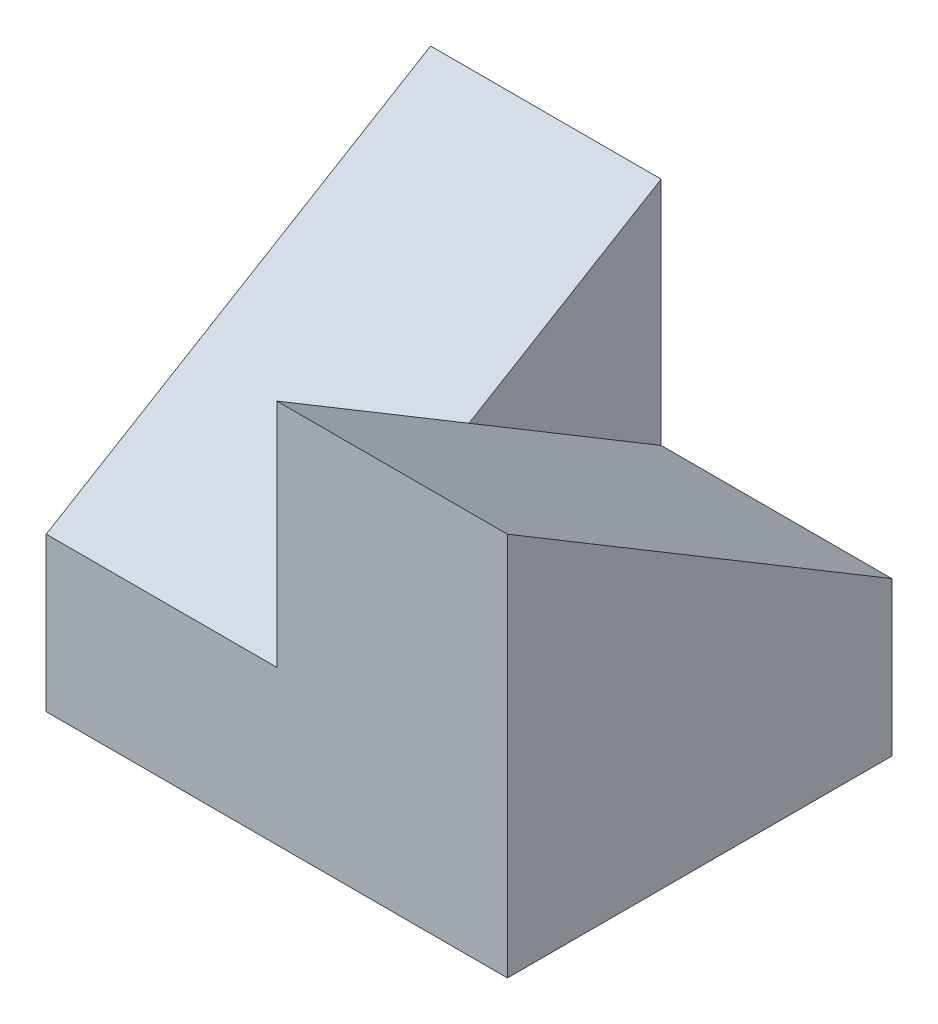
ISO-10303-21;
HEADER;
FILE_DESCRIPTION(('STEP AP214'),'2;1');
FILE_NAME('part.step','',(''),(''),'','','');
FILE_SCHEMA(('AUTOMOTIVE_DESIGN { 1 0 10303 214 1 1 1 1 }'));
ENDSEC;
DATA;
#1=APPLICATION_CONTEXT('core data for automotive mechanical design processes');
#2=APPLICATION_PROTOCOL_DEFINITION('international standard','automotive_design',2000,#1);
#3=PRODUCT_CONTEXT('',#1,'mechanical');
#4=PRODUCT('Part','Part','',(#3));
#5=PRODUCT_RELATED_PRODUCT_CATEGORY('part','',(#4));
#6=PRODUCT_DEFINITION_FORMATION('','',#4);
#7=PRODUCT_DEFINITION_CONTEXT('part definition',#1,'design');
#8=PRODUCT_DEFINITION('design','',#6,#7);
#9=PRODUCT_DEFINITION_SHAPE('','',#8);
#10=(LENGTH_UNIT() NAMED_UNIT(*) SI_UNIT(.MILLI.,.METRE.));
#11=(NAMED_UNIT(*) PLANE_ANGLE_UNIT() SI_UNIT($,.RADIAN.));
#12=(NAMED_UNIT(*) SI_UNIT($,.STERADIAN.) SOLID_ANGLE_UNIT());
#13=UNCERTAINTY_MEASURE_WITH_UNIT(LENGTH_MEASURE(1.E-05),#10,'distance_accuracy_value','');
#14=(GEOMETRIC_REPRESENTATION_CONTEXT(3) GLOBAL_UNCERTAINTY_ASSIGNED_CONTEXT((#13)) GLOBAL_UNIT_ASSIGNED_CONTEXT((#10,
#11,#12)) REPRESENTATION_CONTEXT('',''));
#15=CARTESIAN_POINT('',(0.,0.,0.));
#16=DIRECTION('',(0.,0.,1.));
#17=DIRECTION('',(1.,0.,0.));
#18=AXIS2_PLACEMENT_3D('',#15,#16,#17);
#19=CARTESIAN_POINT('',(-15.,10.,25.));
#20=DIRECTION('',(1.,0.,0.));
#21=DIRECTION('',(0.,0.,-1.));
#22=AXIS2_PLACEMENT_3D('',#19,#20,#21);
#23=PLANE('',#22);
#24=DIRECTION('',(0.,0.514495755427526,-0.857492925712544));
#25=VECTOR('',#24,1.);
#26=CARTESIAN_POINT('',(-15.,25.,0.));
#27=LINE('',#26,#25);
#28=CARTESIAN_POINT('',(-15.,10.,25.));
#29=VERTEX_POINT('',#28);
#30=CARTESIAN_POINT('',(-15.,17.5,12.5));
#31=VERTEX_POINT('',#30);
#32=EDGE_CURVE('E48',#29,#31,#27,.T.);
#33=ORIENTED_EDGE('',*,*,#32,.F.);
#34=DIRECTION('',(0.,-1.,0.));
#35=VECTOR('',#34,1.);
#36=CARTESIAN_POINT('',(-15.,10.,25.));
#37=LINE('',#36,#35);
#38=CARTESIAN_POINT('',(-15.,25.,25.));
#39=VERTEX_POINT('',#38);
#40=EDGE_CURVE('E130',#39,#29,#37,.T.);
#41=ORIENTED_EDGE('',*,*,#40,.F.);
#42=DIRECTION('',(0.,0.514495755427526,0.857492925712544));
#43=VECTOR('',#42,1.);
#44=CARTESIAN_POINT('',(-15.,10.,0.));
#45=LINE('',#44,#43);
#46=EDGE_CURVE('E111',#31,#39,#45,.T.);
#47=ORIENTED_EDGE('',*,*,#46,.F.);
#48=EDGE_LOOP('',(#33,#41,#47));
#49=FACE_BOUND('',#48,.T.);
#50=ADVANCED_FACE('F33',(#49),#23,.F.);
#51=CARTESIAN_POINT('',(-30.,0.,25.));
#52=DIRECTION('',(1.,0.,0.));
#53=DIRECTION('',(0.,0.,-1.));
#54=AXIS2_PLACEMENT_3D('',#51,#52,#53);
#55=PLANE('',#54);
#56=DIRECTION('',(0.,-1.,0.));
#57=VECTOR('',#56,1.);
#58=CARTESIAN_POINT('',(-30.,0.,0.));
#59=LINE('',#58,#57);
#60=CARTESIAN_POINT('',(-30.,25.,0.));
#61=VERTEX_POINT('',#60);
#62=CARTESIAN_POINT('',(-30.,0.,0.));
#63=VERTEX_POINT('',#62);
#64=EDGE_CURVE('E89',#61,#63,#59,.T.);
#65=ORIENTED_EDGE('',*,*,#64,.T.);
#66=DIRECTION('',(0.,0.,-1.));
#67=VECTOR('',#66,1.);
#68=CARTESIAN_POINT('',(-30.,0.,25.));
#69=LINE('',#68,#67);
#70=CARTESIAN_POINT('',(-30.,0.,25.));
#71=VERTEX_POINT('',#70);
#72=EDGE_CURVE('E41',#71,#63,#69,.T.);
#73=ORIENTED_EDGE('',*,*,#72,.F.);
#74=DIRECTION('',(0.,-1.,0.));
#75=VECTOR('',#74,1.);
#76=CARTESIAN_POINT('',(-30.,0.,25.));
#77=LINE('',#76,#75);
#78=CARTESIAN_POINT('',(-30.,10.,25.));
#79=VERTEX_POINT('',#78);
#80=EDGE_CURVE('E104',#79,#71,#77,.T.);
#81=ORIENTED_EDGE('',*,*,#80,.F.);
#82=DIRECTION('',(0.,0.514495755427526,-0.857492925712544));
#83=VECTOR('',#82,1.);
#84=CARTESIAN_POINT('',(-30.,25.,0.));
#85=LINE('',#84,#83);
#86=EDGE_CURVE('E102',#79,#61,#85,.T.);
#87=ORIENTED_EDGE('',*,*,#86,.T.);
#88=EDGE_LOOP('',(#65,#73,#81,#87));
#89=FACE_BOUND('',#88,.T.);
#90=ADVANCED_FACE('F35',(#89),#55,.F.);
#91=CARTESIAN_POINT('',(0.,0.,25.));
#92=DIRECTION('',(0.,1.,0.));
#93=DIRECTION('',(-1.,0.,0.));
#94=AXIS2_PLACEMENT_3D('',#91,#92,#93);
#95=PLANE('',#94);
#96=DIRECTION('',(1.,0.,0.));
#97=VECTOR('',#96,1.);
#98=CARTESIAN_POINT('',(0.,0.,0.));
#99=LINE('',#98,#97);
#100=CARTESIAN_POINT('',(0.,0.,0.));
#101=VERTEX_POINT('',#100);
#102=EDGE_CURVE('E96',#63,#101,#99,.T.);
#103=ORIENTED_EDGE('',*,*,#102,.T.);
#104=DIRECTION('',(0.,0.,-1.));
#105=VECTOR('',#104,1.);
#106=CARTESIAN_POINT('',(0.,0.,25.));
#107=LINE('',#106,#105);
#108=CARTESIAN_POINT('',(0.,0.,25.));
#109=VERTEX_POINT('',#108);
#110=EDGE_CURVE('E134',#109,#101,#107,.T.);
#111=ORIENTED_EDGE('',*,*,#110,.F.);
#112=DIRECTION('',(1.,0.,0.));
#113=VECTOR('',#112,1.);
#114=CARTESIAN_POINT('',(0.,0.,25.));
#115=LINE('',#114,#113);
#116=EDGE_CURVE('E121',#71,#109,#115,.T.);
#117=ORIENTED_EDGE('',*,*,#116,.F.);
#118=ORIENTED_EDGE('',*,*,#72,.T.);
#119=EDGE_LOOP('',(#103,#111,#117,#118));
#120=FACE_BOUND('',#119,.T.);
#121=ADVANCED_FACE('F141',(#120),#95,.F.);
#122=CARTESIAN_POINT('',(0.,25.,25.));
#123=DIRECTION('',(-1.,0.,0.));
#124=DIRECTION('',(0.,-1.,0.));
#125=AXIS2_PLACEMENT_3D('',#122,#123,#124);
#126=PLANE('',#125);
#127=DIRECTION('',(0.,1.,0.));
#128=VECTOR('',#127,1.);
#129=CARTESIAN_POINT('',(0.,25.,0.));
#130=LINE('',#129,#128);
#131=CARTESIAN_POINT('',(0.,10.,0.));
#132=VERTEX_POINT('',#131);
#133=EDGE_CURVE('E122',#101,#132,#130,.T.);
#134=ORIENTED_EDGE('',*,*,#133,.T.);
#135=DIRECTION('',(0.,0.514495755427526,0.857492925712544));
#136=VECTOR('',#135,1.);
#137=CARTESIAN_POINT('',(0.,25.,25.));
#138=LINE('',#137,#136);
#139=CARTESIAN_POINT('',(0.,25.,25.));
#140=VERTEX_POINT('',#139);
#141=EDGE_CURVE('E55',#132,#140,#138,.T.);
#142=ORIENTED_EDGE('',*,*,#141,.T.);
#143=DIRECTION('',(0.,1.,0.));
#144=VECTOR('',#143,1.);
#145=CARTESIAN_POINT('',(0.,25.,25.));
#146=LINE('',#145,#144);
#147=EDGE_CURVE('E124',#109,#140,#146,.T.);
#148=ORIENTED_EDGE('',*,*,#147,.F.);
#149=ORIENTED_EDGE('',*,*,#110,.T.);
#150=EDGE_LOOP('',(#134,#142,#148,#149));
#151=FACE_BOUND('',#150,.T.);
#152=ADVANCED_FACE('F168',(#151),#126,.F.);
#153=CARTESIAN_POINT('',(0.,0.,25.));
#154=DIRECTION('',(0.,0.,-1.));
#155=DIRECTION('',(-1.,0.,0.));
#156=AXIS2_PLACEMENT_3D('',#153,#154,#155);
#157=PLANE('',#156);
#158=ORIENTED_EDGE('',*,*,#80,.T.);
#159=ORIENTED_EDGE('',*,*,#116,.T.);
#160=ORIENTED_EDGE('',*,*,#147,.T.);
#161=DIRECTION('',(-1.,0.,0.));
#162=VECTOR('',#161,1.);
#163=CARTESIAN_POINT('',(-15.,25.,25.));
#164=LINE('',#163,#162);
#165=EDGE_CURVE('E127',#140,#39,#164,.T.);
#166=ORIENTED_EDGE('',*,*,#165,.T.);
#167=ORIENTED_EDGE('',*,*,#40,.T.);
#168=DIRECTION('',(-1.,0.,0.));
#169=VECTOR('',#168,1.);
#170=CARTESIAN_POINT('',(-30.,10.,25.));
#171=LINE('',#170,#169);
#172=EDGE_CURVE('E133',#29,#79,#171,.T.);
#173=ORIENTED_EDGE('',*,*,#172,.T.);
#174=EDGE_LOOP('',(#158,#159,#160,#166,#167,#173));
#175=FACE_BOUND('',#174,.T.);
#176=ADVANCED_FACE('F145',(#175),#157,.F.);
#177=CARTESIAN_POINT('',(0.,0.,0.));
#178=DIRECTION('',(0.,0.,-1.));
#179=DIRECTION('',(-1.,0.,0.));
#180=AXIS2_PLACEMENT_3D('',#177,#178,#179);
#181=PLANE('',#180);
#182=DIRECTION('',(-1.,0.,0.));
#183=VECTOR('',#182,1.);
#184=CARTESIAN_POINT('',(0.,10.,0.));
#185=LINE('',#184,#183);
#186=CARTESIAN_POINT('',(-15.,10.,0.));
#187=VERTEX_POINT('',#186);
#188=EDGE_CURVE('E11',#132,#187,#185,.T.);
#189=ORIENTED_EDGE('',*,*,#188,.F.);
#190=ORIENTED_EDGE('',*,*,#133,.F.);
#191=ORIENTED_EDGE('',*,*,#102,.F.);
#192=ORIENTED_EDGE('',*,*,#64,.F.);
#193=DIRECTION('',(1.,0.,0.));
#194=VECTOR('',#193,1.);
#195=CARTESIAN_POINT('',(-30.,25.,0.));
#196=LINE('',#195,#194);
#197=CARTESIAN_POINT('',(-15.,25.,0.));
#198=VERTEX_POINT('',#197);
#199=EDGE_CURVE('E94',#61,#198,#196,.T.);
#200=ORIENTED_EDGE('',*,*,#199,.T.);
#201=DIRECTION('',(0.,-1.,0.));
#202=VECTOR('',#201,1.);
#203=CARTESIAN_POINT('',(-15.,10.,0.));
#204=LINE('',#203,#202);
#205=EDGE_CURVE('E106',#198,#187,#204,.T.);
#206=ORIENTED_EDGE('',*,*,#205,.T.);
#207=EDGE_LOOP('',(#189,#190,#191,#192,#200,#206));
#208=FACE_BOUND('',#207,.T.);
#209=ADVANCED_FACE('F91',(#208),#181,.T.);
#210=CARTESIAN_POINT('',(10.,10.,0.));
#211=DIRECTION('',(0.,-0.857492925712544,0.514495755427526));
#212=DIRECTION('',(0.,-0.514495755427526,-0.857492925712544));
#213=AXIS2_PLACEMENT_3D('',#210,#211,#212);
#214=PLANE('',#213);
#215=ORIENTED_EDGE('',*,*,#188,.T.);
#216=EDGE_CURVE('E113',#187,#31,#45,.T.);
#217=ORIENTED_EDGE('',*,*,#216,.T.);
#218=ORIENTED_EDGE('',*,*,#46,.T.);
#219=ORIENTED_EDGE('',*,*,#165,.F.);
#220=ORIENTED_EDGE('',*,*,#141,.F.);
#221=EDGE_LOOP('',(#215,#217,#218,#219,#220));
#222=FACE_BOUND('',#221,.T.);
#223=ADVANCED_FACE('F150',(#222),#214,.F.);
#224=CARTESIAN_POINT('',(-15.,0.,0.));
#225=DIRECTION('',(-1.,0.,0.));
#226=DIRECTION('',(0.,0.,1.));
#227=AXIS2_PLACEMENT_3D('',#224,#225,#226);
#228=PLANE('',#227);
#229=EDGE_CURVE('E109',#31,#198,#27,.T.);
#230=ORIENTED_EDGE('',*,*,#229,.F.);
#231=ORIENTED_EDGE('',*,*,#216,.F.);
#232=ORIENTED_EDGE('',*,*,#205,.F.);
#233=EDGE_LOOP('',(#230,#231,#232));
#234=FACE_BOUND('',#233,.T.);
#235=ADVANCED_FACE('F151',(#234),#228,.F.);
#236=CARTESIAN_POINT('',(-30.,25.,0.));
#237=DIRECTION('',(0.,-0.857492925712544,-0.514495755427526));
#238=DIRECTION('',(0.,0.514495755427526,-0.857492925712544));
#239=AXIS2_PLACEMENT_3D('',#236,#237,#238);
#240=PLANE('',#239);
#241=ORIENTED_EDGE('',*,*,#32,.T.);
#242=ORIENTED_EDGE('',*,*,#229,.T.);
#243=ORIENTED_EDGE('',*,*,#199,.F.);
#244=ORIENTED_EDGE('',*,*,#86,.F.);
#245=ORIENTED_EDGE('',*,*,#172,.F.);
#246=EDGE_LOOP('',(#241,#242,#243,#244,#245));
#247=FACE_BOUND('',#246,.T.);
#248=ADVANCED_FACE('F108',(#247),#240,.F.);
#249=CLOSED_SHELL('',(#50,#90,#121,#152,#176,#209,#223,#235,#248));
#250=MANIFOLD_SOLID_BREP('B2',#249);
#251=ADVANCED_BREP_SHAPE_REPRESENTATION('',(#18,#250),#14);
#252=SHAPE_DEFINITION_REPRESENTATION(#9,#251);
ENDSEC;
END-ISO-10303-21;
